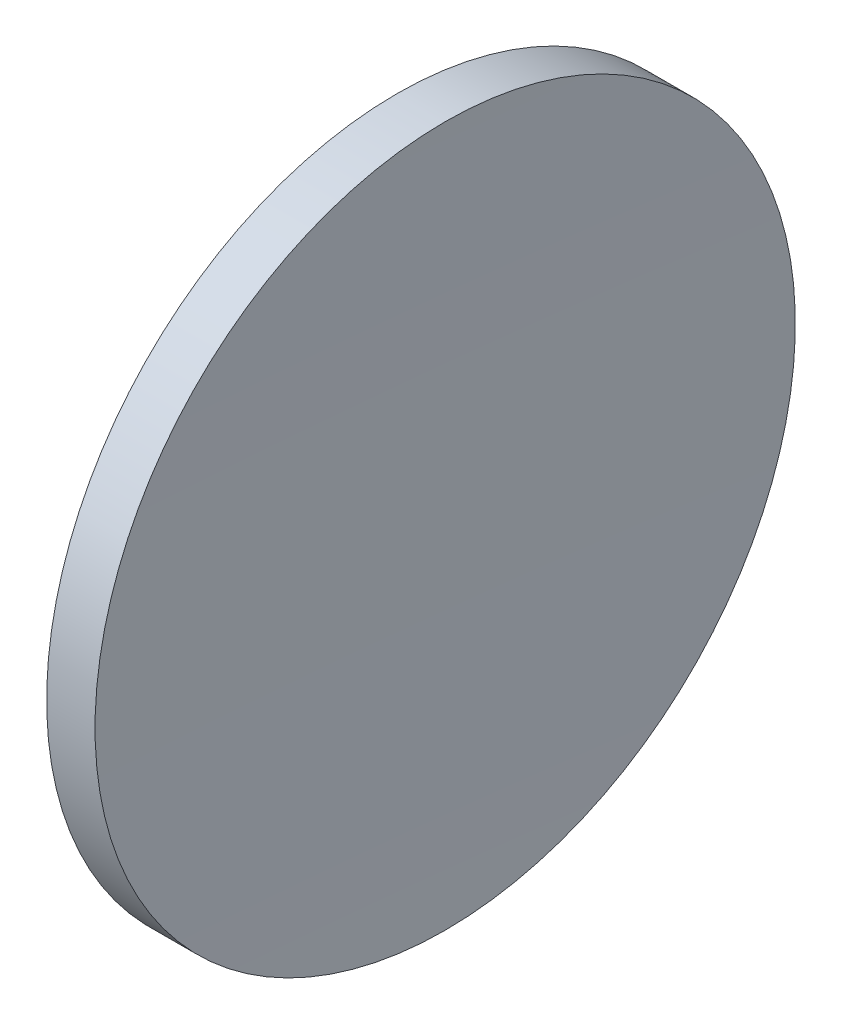
ISO-10303-21;
HEADER;
FILE_DESCRIPTION(('STEP AP214'),'2;1');
FILE_NAME('part.step','',(''),(''),'','','');
FILE_SCHEMA(('AUTOMOTIVE_DESIGN { 1 0 10303 214 1 1 1 1 }'));
ENDSEC;
DATA;
#1=APPLICATION_CONTEXT('core data for automotive mechanical design processes');
#2=APPLICATION_PROTOCOL_DEFINITION('international standard','automotive_design',2000,#1);
#3=PRODUCT_CONTEXT('',#1,'mechanical');
#4=PRODUCT('Part','Part','',(#3));
#5=PRODUCT_RELATED_PRODUCT_CATEGORY('part','',(#4));
#6=PRODUCT_DEFINITION_FORMATION('','',#4);
#7=PRODUCT_DEFINITION_CONTEXT('part definition',#1,'design');
#8=PRODUCT_DEFINITION('design','',#6,#7);
#9=PRODUCT_DEFINITION_SHAPE('','',#8);
#10=(LENGTH_UNIT() NAMED_UNIT(*) SI_UNIT(.MILLI.,.METRE.));
#11=(NAMED_UNIT(*) PLANE_ANGLE_UNIT() SI_UNIT($,.RADIAN.));
#12=(NAMED_UNIT(*) SI_UNIT($,.STERADIAN.) SOLID_ANGLE_UNIT());
#13=UNCERTAINTY_MEASURE_WITH_UNIT(LENGTH_MEASURE(1.E-05),#10,'distance_accuracy_value','');
#14=(GEOMETRIC_REPRESENTATION_CONTEXT(3) GLOBAL_UNCERTAINTY_ASSIGNED_CONTEXT((#13)) GLOBAL_UNIT_ASSIGNED_CONTEXT((#10,
#11,#12)) REPRESENTATION_CONTEXT('',''));
#15=CARTESIAN_POINT('',(0.,0.,0.));
#16=DIRECTION('',(0.,0.,1.));
#17=DIRECTION('',(1.,0.,0.));
#18=AXIS2_PLACEMENT_3D('',#15,#16,#17);
#19=CARTESIAN_POINT('',(1449.18213112149,130.433680941875,0.));
#20=DIRECTION('',(-1.,0.,0.));
#21=DIRECTION('',(0.,1.,0.));
#22=AXIS2_PLACEMENT_3D('',#19,#20,#21);
#23=SPHERICAL_SURFACE('',#22,1200.);
#24=CARTESIAN_POINT('',(249.442576051308,130.433680941881,0.));
#25=DIRECTION('',(-1.,0.,0.));
#26=DIRECTION('',(0.,-1.,0.));
#27=AXIS2_PLACEMENT_3D('',#24,#25,#26);
#28=CIRCLE('',#27,25.0000000000001);
#29=CARTESIAN_POINT('',(249.442576051308,105.433680941881,0.));
#30=VERTEX_POINT('',#29);
#31=EDGE_CURVE('E10',#30,#30,#28,.T.);
#32=ORIENTED_EDGE('',*,*,#31,.F.);
#33=EDGE_LOOP('',(#32));
#34=FACE_BOUND('',#33,.T.);
#35=ADVANCED_FACE('F35',(#34),#23,.F.);
#36=CARTESIAN_POINT('',(231.888982595926,130.433680941881,0.));
#37=DIRECTION('',(-1.,0.,0.));
#38=DIRECTION('',(0.,-1.,0.));
#39=AXIS2_PLACEMENT_3D('',#36,#37,#38);
#40=CYLINDRICAL_SURFACE('',#39,25.);
#41=CARTESIAN_POINT('',(245.987314078653,130.433680941881,0.));
#42=DIRECTION('',(-1.,0.,0.));
#43=DIRECTION('',(0.,-1.,0.));
#44=AXIS2_PLACEMENT_3D('',#41,#42,#43);
#45=CIRCLE('',#44,24.9999999999999);
#46=CARTESIAN_POINT('',(245.987314078653,105.433680941881,0.));
#47=VERTEX_POINT('',#46);
#48=EDGE_CURVE('E41',#47,#47,#45,.T.);
#49=ORIENTED_EDGE('',*,*,#48,.F.);
#50=EDGE_LOOP('',(#49));
#51=FACE_BOUND('',#50,.T.);
#52=ORIENTED_EDGE('',*,*,#31,.T.);
#53=EDGE_LOOP('',(#52));
#54=FACE_BOUND('',#53,.T.);
#55=ADVANCED_FACE('F49',(#51,#54),#40,.T.);
#56=CARTESIAN_POINT('',(688.78213112149,130.433680941881,0.));
#57=DIRECTION('',(-1.,0.,0.));
#58=DIRECTION('',(0.,1.,0.));
#59=AXIS2_PLACEMENT_3D('',#56,#57,#58);
#60=SPHERICAL_SURFACE('',#59,443.5);
#61=ORIENTED_EDGE('',*,*,#48,.T.);
#62=EDGE_LOOP('',(#61));
#63=FACE_BOUND('',#62,.T.);
#64=ADVANCED_FACE('F47',(#63),#60,.T.);
#65=CLOSED_SHELL('',(#35,#55,#64));
#66=MANIFOLD_SOLID_BREP('B2',#65);
#67=ADVANCED_BREP_SHAPE_REPRESENTATION('',(#18,#66),#14);
#68=SHAPE_DEFINITION_REPRESENTATION(#9,#67);
ENDSEC;
END-ISO-10303-21;
